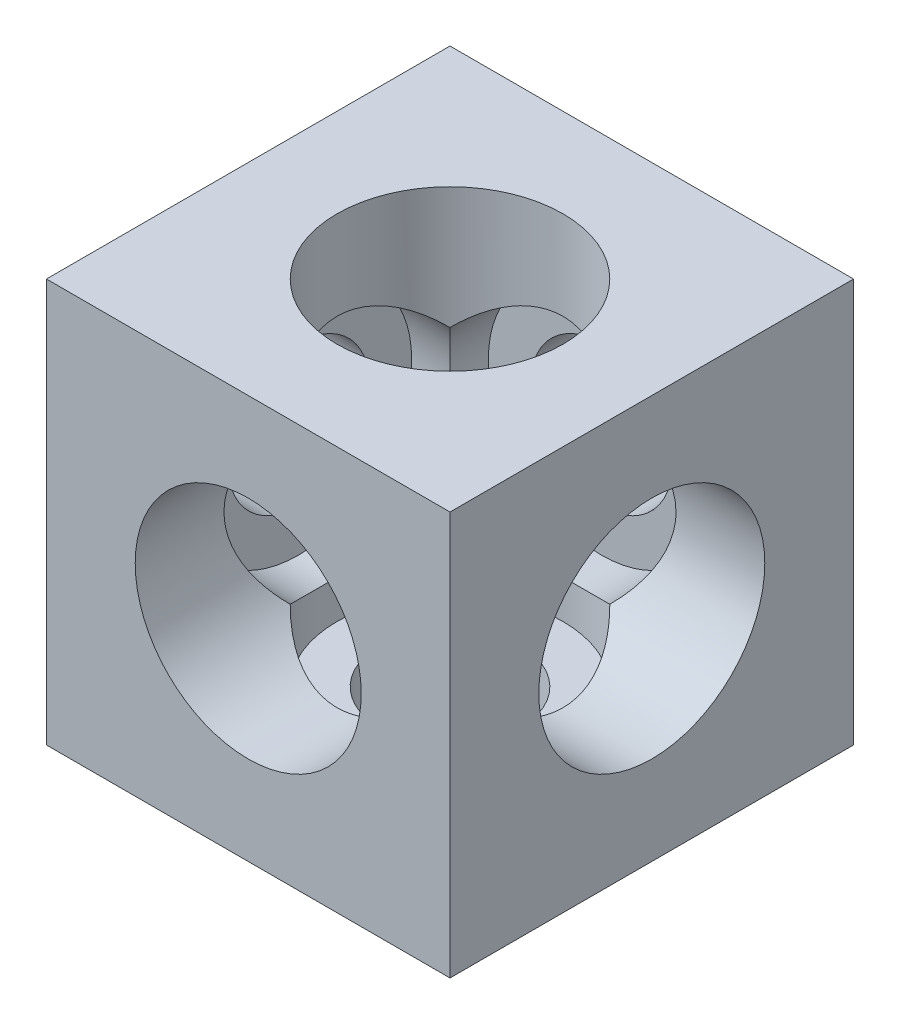
ISO-10303-21;
HEADER;
FILE_DESCRIPTION(('STEP AP214'),'2;1');
FILE_NAME('part.step','',(''),(''),'','','');
FILE_SCHEMA(('AUTOMOTIVE_DESIGN { 1 0 10303 214 1 1 1 1 }'));
ENDSEC;
DATA;
#1=APPLICATION_CONTEXT('core data for automotive mechanical design processes');
#2=APPLICATION_PROTOCOL_DEFINITION('international standard','automotive_design',2000,#1);
#3=PRODUCT_CONTEXT('',#1,'mechanical');
#4=PRODUCT('Part','Part','',(#3));
#5=PRODUCT_RELATED_PRODUCT_CATEGORY('part','',(#4));
#6=PRODUCT_DEFINITION_FORMATION('','',#4);
#7=PRODUCT_DEFINITION_CONTEXT('part definition',#1,'design');
#8=PRODUCT_DEFINITION('design','',#6,#7);
#9=PRODUCT_DEFINITION_SHAPE('','',#8);
#10=(LENGTH_UNIT() NAMED_UNIT(*) SI_UNIT(.MILLI.,.METRE.));
#11=(NAMED_UNIT(*) PLANE_ANGLE_UNIT() SI_UNIT($,.RADIAN.));
#12=(NAMED_UNIT(*) SI_UNIT($,.STERADIAN.) SOLID_ANGLE_UNIT());
#13=UNCERTAINTY_MEASURE_WITH_UNIT(LENGTH_MEASURE(1.E-05),#10,'distance_accuracy_value','');
#14=(GEOMETRIC_REPRESENTATION_CONTEXT(3) GLOBAL_UNCERTAINTY_ASSIGNED_CONTEXT((#13)) GLOBAL_UNIT_ASSIGNED_CONTEXT((#10,
#11,#12)) REPRESENTATION_CONTEXT('',''));
#15=CARTESIAN_POINT('',(0.,0.,0.));
#16=DIRECTION('',(0.,0.,1.));
#17=DIRECTION('',(1.,0.,0.));
#18=AXIS2_PLACEMENT_3D('',#15,#16,#17);
#19=CARTESIAN_POINT('',(-10.,0.,0.));
#20=DIRECTION('',(1.,0.,0.));
#21=DIRECTION('',(0.,0.,-1.));
#22=AXIS2_PLACEMENT_3D('',#19,#20,#21);
#23=CYLINDRICAL_SURFACE('',#22,3.5);
#24=CARTESIAN_POINT('',(-10.,0.,0.));
#25=DIRECTION('',(1.,0.,0.));
#26=DIRECTION('',(0.,0.,-1.));
#27=AXIS2_PLACEMENT_3D('',#24,#25,#26);
#28=CIRCLE('',#27,3.5);
#29=CARTESIAN_POINT('',(-10.,0.,-3.5));
#30=VERTEX_POINT('',#29);
#31=EDGE_CURVE('E145',#30,#30,#28,.T.);
#32=ORIENTED_EDGE('',*,*,#31,.F.);
#33=EDGE_LOOP('',(#32));
#34=FACE_BOUND('',#33,.T.);
#35=CARTESIAN_POINT('',(-7.5,0.,0.));
#36=DIRECTION('',(1.,0.,0.));
#37=DIRECTION('',(0.,0.,-1.));
#38=AXIS2_PLACEMENT_3D('',#35,#36,#37);
#39=CIRCLE('',#38,3.5);
#40=CARTESIAN_POINT('',(-7.5,0.,-3.5));
#41=VERTEX_POINT('',#40);
#42=EDGE_CURVE('E38',#41,#41,#39,.F.);
#43=ORIENTED_EDGE('',*,*,#42,.F.);
#44=EDGE_LOOP('',(#43));
#45=FACE_BOUND('',#44,.T.);
#46=ADVANCED_FACE('F34',(#34,#45),#23,.F.);
#47=CARTESIAN_POINT('',(0.,0.,-10.));
#48=DIRECTION('',(0.,0.,1.));
#49=DIRECTION('',(1.,0.,0.));
#50=AXIS2_PLACEMENT_3D('',#47,#48,#49);
#51=CYLINDRICAL_SURFACE('',#50,3.5);
#52=CARTESIAN_POINT('',(0.,0.,-10.));
#53=DIRECTION('',(0.,0.,1.));
#54=DIRECTION('',(1.,0.,0.));
#55=AXIS2_PLACEMENT_3D('',#52,#53,#54);
#56=CIRCLE('',#55,3.5);
#57=CARTESIAN_POINT('',(3.5,0.,-10.));
#58=VERTEX_POINT('',#57);
#59=EDGE_CURVE('E148',#58,#58,#56,.T.);
#60=ORIENTED_EDGE('',*,*,#59,.F.);
#61=EDGE_LOOP('',(#60));
#62=FACE_BOUND('',#61,.T.);
#63=CARTESIAN_POINT('',(0.,0.,-7.5));
#64=DIRECTION('',(0.,0.,1.));
#65=DIRECTION('',(1.,0.,0.));
#66=AXIS2_PLACEMENT_3D('',#63,#64,#65);
#67=CIRCLE('',#66,3.5);
#68=CARTESIAN_POINT('',(3.5,0.,-7.5));
#69=VERTEX_POINT('',#68);
#70=EDGE_CURVE('E122',#69,#69,#67,.F.);
#71=ORIENTED_EDGE('',*,*,#70,.F.);
#72=EDGE_LOOP('',(#71));
#73=FACE_BOUND('',#72,.T.);
#74=ADVANCED_FACE('F223',(#62,#73),#51,.F.);
#75=CARTESIAN_POINT('',(0.,-7.5,0.));
#76=DIRECTION('',(0.,1.,0.));
#77=DIRECTION('',(-1.,0.,0.));
#78=AXIS2_PLACEMENT_3D('',#75,#76,#77);
#79=CYLINDRICAL_SURFACE('',#78,5.6);
#80=CARTESIAN_POINT('',(0.,10.,0.));
#81=DIRECTION('',(0.,1.,0.));
#82=DIRECTION('',(-1.,0.,0.));
#83=AXIS2_PLACEMENT_3D('',#80,#81,#82);
#84=CIRCLE('',#83,5.6);
#85=CARTESIAN_POINT('',(-5.6,10.,0.));
#86=VERTEX_POINT('',#85);
#87=EDGE_CURVE('E124',#86,#86,#84,.T.);
#88=ORIENTED_EDGE('',*,*,#87,.T.);
#89=EDGE_LOOP('',(#88));
#90=FACE_BOUND('',#89,.T.);
#91=CARTESIAN_POINT('',(0.,0.,0.));
#92=DIRECTION('',(0.,0.707106781186547,-0.707106781186547));
#93=DIRECTION('',(0.,0.707106781186547,0.707106781186547));
#94=AXIS2_PLACEMENT_3D('',#91,#92,#93);
#95=ELLIPSE('',#94,7.91959594928933,5.6);
#96=CARTESIAN_POINT('',(3.95979797464466,3.95979797464467,3.95979797464467));
#97=VERTEX_POINT('',#96);
#98=CARTESIAN_POINT('',(-3.95979797464467,3.95979797464467,3.95979797464467));
#99=VERTEX_POINT('',#98);
#100=EDGE_CURVE('E111',#97,#99,#95,.F.);
#101=ORIENTED_EDGE('',*,*,#100,.T.);
#102=CARTESIAN_POINT('',(0.,0.,0.));
#103=DIRECTION('',(0.707106781186547,0.707106781186548,0.));
#104=DIRECTION('',(-0.707106781186547,0.707106781186547,0.));
#105=AXIS2_PLACEMENT_3D('',#102,#103,#104);
#106=ELLIPSE('',#105,7.91959594928933,5.6);
#107=CARTESIAN_POINT('',(-3.95979797464466,3.95979797464466,-3.95979797464467));
#108=VERTEX_POINT('',#107);
#109=EDGE_CURVE('E98',#99,#108,#106,.F.);
#110=ORIENTED_EDGE('',*,*,#109,.T.);
#111=CARTESIAN_POINT('',(0.,0.,0.));
#112=DIRECTION('',(0.,0.707106781186547,0.707106781186547));
#113=DIRECTION('',(0.,0.707106781186547,-0.707106781186547));
#114=AXIS2_PLACEMENT_3D('',#111,#112,#113);
#115=ELLIPSE('',#114,7.91959594928933,5.6);
#116=CARTESIAN_POINT('',(3.95979797464466,3.95979797464466,-3.95979797464467));
#117=VERTEX_POINT('',#116);
#118=EDGE_CURVE('E104',#108,#117,#115,.F.);
#119=ORIENTED_EDGE('',*,*,#118,.T.);
#120=CARTESIAN_POINT('',(0.,0.,0.));
#121=DIRECTION('',(-0.707106781186547,0.707106781186547,0.));
#122=DIRECTION('',(0.707106781186547,0.707106781186548,0.));
#123=AXIS2_PLACEMENT_3D('',#120,#121,#122);
#124=ELLIPSE('',#123,7.91959594928933,5.6);
#125=EDGE_CURVE('E50',#117,#97,#124,.F.);
#126=ORIENTED_EDGE('',*,*,#125,.T.);
#127=EDGE_LOOP('',(#101,#110,#119,#126));
#128=FACE_BOUND('',#127,.T.);
#129=ADVANCED_FACE('F109',(#90,#128),#79,.F.);
#130=CARTESIAN_POINT('',(0.,-10.,0.));
#131=DIRECTION('',(0.,1.,0.));
#132=DIRECTION('',(-1.,0.,0.));
#133=AXIS2_PLACEMENT_3D('',#130,#131,#132);
#134=CYLINDRICAL_SURFACE('',#133,3.5);
#135=CARTESIAN_POINT('',(0.,-10.,0.));
#136=DIRECTION('',(0.,1.,0.));
#137=DIRECTION('',(-1.,0.,0.));
#138=AXIS2_PLACEMENT_3D('',#135,#136,#137);
#139=CIRCLE('',#138,3.5);
#140=CARTESIAN_POINT('',(-3.5,-10.,0.));
#141=VERTEX_POINT('',#140);
#142=EDGE_CURVE('E151',#141,#141,#139,.T.);
#143=ORIENTED_EDGE('',*,*,#142,.F.);
#144=EDGE_LOOP('',(#143));
#145=FACE_BOUND('',#144,.T.);
#146=CARTESIAN_POINT('',(0.,-7.5,0.));
#147=DIRECTION('',(0.,1.,0.));
#148=DIRECTION('',(-1.,0.,0.));
#149=AXIS2_PLACEMENT_3D('',#146,#147,#148);
#150=CIRCLE('',#149,3.5);
#151=CARTESIAN_POINT('',(-3.5,-7.5,0.));
#152=VERTEX_POINT('',#151);
#153=EDGE_CURVE('E143',#152,#152,#150,.F.);
#154=ORIENTED_EDGE('',*,*,#153,.F.);
#155=EDGE_LOOP('',(#154));
#156=FACE_BOUND('',#155,.T.);
#157=ADVANCED_FACE('F236',(#145,#156),#134,.F.);
#158=CARTESIAN_POINT('',(-10.,-10.,10.));
#159=DIRECTION('',(1.,0.,0.));
#160=DIRECTION('',(0.,0.,-1.));
#161=AXIS2_PLACEMENT_3D('',#158,#159,#160);
#162=PLANE('',#161);
#163=ORIENTED_EDGE('',*,*,#31,.T.);
#164=EDGE_LOOP('',(#163));
#165=FACE_BOUND('',#164,.T.);
#166=DIRECTION('',(0.,-1.,0.));
#167=VECTOR('',#166,1.);
#168=CARTESIAN_POINT('',(-10.,-10.,-10.));
#169=LINE('',#168,#167);
#170=CARTESIAN_POINT('',(-10.,10.,-10.));
#171=VERTEX_POINT('',#170);
#172=CARTESIAN_POINT('',(-10.,-10.,-10.));
#173=VERTEX_POINT('',#172);
#174=EDGE_CURVE('E154',#171,#173,#169,.T.);
#175=ORIENTED_EDGE('',*,*,#174,.T.);
#176=DIRECTION('',(0.,0.,-1.));
#177=VECTOR('',#176,1.);
#178=CARTESIAN_POINT('',(-10.,-10.,10.));
#179=LINE('',#178,#177);
#180=CARTESIAN_POINT('',(-10.,-10.,10.));
#181=VERTEX_POINT('',#180);
#182=EDGE_CURVE('E181',#181,#173,#179,.T.);
#183=ORIENTED_EDGE('',*,*,#182,.F.);
#184=DIRECTION('',(0.,-1.,0.));
#185=VECTOR('',#184,1.);
#186=CARTESIAN_POINT('',(-10.,-10.,10.));
#187=LINE('',#186,#185);
#188=CARTESIAN_POINT('',(-10.,10.,10.));
#189=VERTEX_POINT('',#188);
#190=EDGE_CURVE('E155',#189,#181,#187,.T.);
#191=ORIENTED_EDGE('',*,*,#190,.F.);
#192=DIRECTION('',(0.,0.,-1.));
#193=VECTOR('',#192,1.);
#194=CARTESIAN_POINT('',(-10.,10.,10.));
#195=LINE('',#194,#193);
#196=EDGE_CURVE('E165',#189,#171,#195,.T.);
#197=ORIENTED_EDGE('',*,*,#196,.T.);
#198=EDGE_LOOP('',(#175,#183,#191,#197));
#199=FACE_BOUND('',#198,.T.);
#200=ADVANCED_FACE('F36',(#165,#199),#162,.F.);
#201=CARTESIAN_POINT('',(10.,-9.99999999999999,10.));
#202=DIRECTION('',(0.,1.,0.));
#203=DIRECTION('',(-1.,0.,0.));
#204=AXIS2_PLACEMENT_3D('',#201,#202,#203);
#205=PLANE('',#204);
#206=ORIENTED_EDGE('',*,*,#142,.T.);
#207=EDGE_LOOP('',(#206));
#208=FACE_BOUND('',#207,.T.);
#209=DIRECTION('',(1.,0.,0.));
#210=VECTOR('',#209,1.);
#211=CARTESIAN_POINT('',(10.,-9.99999999999999,-10.));
#212=LINE('',#211,#210);
#213=CARTESIAN_POINT('',(10.,-9.99999999999999,-10.));
#214=VERTEX_POINT('',#213);
#215=EDGE_CURVE('E168',#173,#214,#212,.T.);
#216=ORIENTED_EDGE('',*,*,#215,.T.);
#217=DIRECTION('',(0.,0.,-1.));
#218=VECTOR('',#217,1.);
#219=CARTESIAN_POINT('',(10.,-9.99999999999999,10.));
#220=LINE('',#219,#218);
#221=CARTESIAN_POINT('',(10.,-9.99999999999999,10.));
#222=VERTEX_POINT('',#221);
#223=EDGE_CURVE('E178',#222,#214,#220,.T.);
#224=ORIENTED_EDGE('',*,*,#223,.F.);
#225=DIRECTION('',(1.,0.,0.));
#226=VECTOR('',#225,1.);
#227=CARTESIAN_POINT('',(10.,-9.99999999999999,10.));
#228=LINE('',#227,#226);
#229=EDGE_CURVE('E158',#181,#222,#228,.T.);
#230=ORIENTED_EDGE('',*,*,#229,.F.);
#231=ORIENTED_EDGE('',*,*,#182,.T.);
#232=EDGE_LOOP('',(#216,#224,#230,#231));
#233=FACE_BOUND('',#232,.T.);
#234=ADVANCED_FACE('F255',(#208,#233),#205,.F.);
#235=CARTESIAN_POINT('',(10.,-9.99999999999999,10.));
#236=DIRECTION('',(-1.,0.,0.));
#237=DIRECTION('',(0.,0.,1.));
#238=AXIS2_PLACEMENT_3D('',#235,#236,#237);
#239=PLANE('',#238);
#240=CARTESIAN_POINT('',(10.,0.,0.));
#241=DIRECTION('',(1.,0.,0.));
#242=DIRECTION('',(0.,0.,-1.));
#243=AXIS2_PLACEMENT_3D('',#240,#241,#242);
#244=CIRCLE('',#243,5.6);
#245=CARTESIAN_POINT('',(10.,0.,-5.6));
#246=VERTEX_POINT('',#245);
#247=EDGE_CURVE('E198',#246,#246,#244,.T.);
#248=ORIENTED_EDGE('',*,*,#247,.F.);
#249=EDGE_LOOP('',(#248));
#250=FACE_BOUND('',#249,.T.);
#251=DIRECTION('',(0.,1.,0.));
#252=VECTOR('',#251,1.);
#253=CARTESIAN_POINT('',(10.,-9.99999999999999,-10.));
#254=LINE('',#253,#252);
#255=CARTESIAN_POINT('',(10.,10.,-10.));
#256=VERTEX_POINT('',#255);
#257=EDGE_CURVE('E170',#214,#256,#254,.T.);
#258=ORIENTED_EDGE('',*,*,#257,.T.);
#259=DIRECTION('',(0.,0.,-1.));
#260=VECTOR('',#259,1.);
#261=CARTESIAN_POINT('',(10.,10.,10.));
#262=LINE('',#261,#260);
#263=CARTESIAN_POINT('',(10.,10.,10.));
#264=VERTEX_POINT('',#263);
#265=EDGE_CURVE('E175',#264,#256,#262,.T.);
#266=ORIENTED_EDGE('',*,*,#265,.F.);
#267=DIRECTION('',(0.,1.,0.));
#268=VECTOR('',#267,1.);
#269=CARTESIAN_POINT('',(10.,-9.99999999999999,10.));
#270=LINE('',#269,#268);
#271=EDGE_CURVE('E161',#222,#264,#270,.T.);
#272=ORIENTED_EDGE('',*,*,#271,.F.);
#273=ORIENTED_EDGE('',*,*,#223,.T.);
#274=EDGE_LOOP('',(#258,#266,#272,#273));
#275=FACE_BOUND('',#274,.T.);
#276=ADVANCED_FACE('F252',(#250,#275),#239,.F.);
#277=CARTESIAN_POINT('',(10.,10.,10.));
#278=DIRECTION('',(0.,-1.,0.));
#279=DIRECTION('',(1.,0.,0.));
#280=AXIS2_PLACEMENT_3D('',#277,#278,#279);
#281=PLANE('',#280);
#282=ORIENTED_EDGE('',*,*,#87,.F.);
#283=EDGE_LOOP('',(#282));
#284=FACE_BOUND('',#283,.T.);
#285=DIRECTION('',(-1.,0.,0.));
#286=VECTOR('',#285,1.);
#287=CARTESIAN_POINT('',(10.,10.,-10.));
#288=LINE('',#287,#286);
#289=EDGE_CURVE('E159',#256,#171,#288,.T.);
#290=ORIENTED_EDGE('',*,*,#289,.T.);
#291=ORIENTED_EDGE('',*,*,#196,.F.);
#292=DIRECTION('',(-1.,0.,0.));
#293=VECTOR('',#292,1.);
#294=CARTESIAN_POINT('',(10.,10.,10.));
#295=LINE('',#294,#293);
#296=EDGE_CURVE('E163',#264,#189,#295,.T.);
#297=ORIENTED_EDGE('',*,*,#296,.F.);
#298=ORIENTED_EDGE('',*,*,#265,.T.);
#299=EDGE_LOOP('',(#290,#291,#297,#298));
#300=FACE_BOUND('',#299,.T.);
#301=ADVANCED_FACE('F244',(#284,#300),#281,.F.);
#302=CARTESIAN_POINT('',(0.,0.,10.));
#303=DIRECTION('',(0.,0.,1.));
#304=DIRECTION('',(1.,0.,0.));
#305=AXIS2_PLACEMENT_3D('',#302,#303,#304);
#306=PLANE('',#305);
#307=CARTESIAN_POINT('',(0.,0.,10.));
#308=DIRECTION('',(0.,0.,1.));
#309=DIRECTION('',(1.,0.,0.));
#310=AXIS2_PLACEMENT_3D('',#307,#308,#309);
#311=CIRCLE('',#310,5.6);
#312=CARTESIAN_POINT('',(5.6,0.,10.));
#313=VERTEX_POINT('',#312);
#314=EDGE_CURVE('E132',#313,#313,#311,.T.);
#315=ORIENTED_EDGE('',*,*,#314,.F.);
#316=EDGE_LOOP('',(#315));
#317=FACE_BOUND('',#316,.T.);
#318=ORIENTED_EDGE('',*,*,#190,.T.);
#319=ORIENTED_EDGE('',*,*,#229,.T.);
#320=ORIENTED_EDGE('',*,*,#271,.T.);
#321=ORIENTED_EDGE('',*,*,#296,.T.);
#322=EDGE_LOOP('',(#318,#319,#320,#321));
#323=FACE_BOUND('',#322,.T.);
#324=ADVANCED_FACE('F240',(#317,#323),#306,.T.);
#325=CARTESIAN_POINT('',(0.,0.,-10.));
#326=DIRECTION('',(0.,0.,1.));
#327=DIRECTION('',(1.,0.,0.));
#328=AXIS2_PLACEMENT_3D('',#325,#326,#327);
#329=PLANE('',#328);
#330=ORIENTED_EDGE('',*,*,#59,.T.);
#331=EDGE_LOOP('',(#330));
#332=FACE_BOUND('',#331,.T.);
#333=ORIENTED_EDGE('',*,*,#174,.F.);
#334=ORIENTED_EDGE('',*,*,#289,.F.);
#335=ORIENTED_EDGE('',*,*,#257,.F.);
#336=ORIENTED_EDGE('',*,*,#215,.F.);
#337=EDGE_LOOP('',(#333,#334,#335,#336));
#338=FACE_BOUND('',#337,.T.);
#339=ADVANCED_FACE('F243',(#332,#338),#329,.F.);
#340=CARTESIAN_POINT('',(0.,-7.5,0.));
#341=DIRECTION('',(0.,1.,0.));
#342=DIRECTION('',(-1.,0.,0.));
#343=AXIS2_PLACEMENT_3D('',#340,#341,#342);
#344=PLANE('',#343);
#345=CARTESIAN_POINT('',(0.,-7.5,0.));
#346=DIRECTION('',(0.,1.,0.));
#347=DIRECTION('',(-1.,0.,0.));
#348=AXIS2_PLACEMENT_3D('',#345,#346,#347);
#349=CIRCLE('',#348,5.6);
#350=CARTESIAN_POINT('',(-5.6,-7.5,0.));
#351=VERTEX_POINT('',#350);
#352=EDGE_CURVE('E129',#351,#351,#349,.T.);
#353=ORIENTED_EDGE('',*,*,#352,.T.);
#354=EDGE_LOOP('',(#353));
#355=FACE_BOUND('',#354,.T.);
#356=ORIENTED_EDGE('',*,*,#153,.T.);
#357=EDGE_LOOP('',(#356));
#358=FACE_BOUND('',#357,.T.);
#359=ADVANCED_FACE('F248',(#355,#358),#344,.T.);
#360=CARTESIAN_POINT('',(0.,0.,0.));
#361=DIRECTION('',(0.,0.707106781186547,0.707106781186547));
#362=DIRECTION('',(0.,0.707106781186547,-0.707106781186547));
#363=AXIS2_PLACEMENT_3D('',#360,#361,#362);
#364=ELLIPSE('',#363,7.91959594928933,5.6);
#365=CARTESIAN_POINT('',(-3.95979797464466,-3.95979797464467,3.95979797464467));
#366=VERTEX_POINT('',#365);
#367=CARTESIAN_POINT('',(3.95979797464467,-3.95979797464467,3.95979797464467));
#368=VERTEX_POINT('',#367);
#369=EDGE_CURVE('E115',#366,#368,#364,.T.);
#370=ORIENTED_EDGE('',*,*,#369,.T.);
#371=CARTESIAN_POINT('',(0.,0.,0.));
#372=DIRECTION('',(0.707106781186547,0.707106781186548,0.));
#373=DIRECTION('',(-0.707106781186547,0.707106781186547,0.));
#374=AXIS2_PLACEMENT_3D('',#371,#372,#373);
#375=ELLIPSE('',#374,7.91959594928933,5.6);
#376=CARTESIAN_POINT('',(3.95979797464466,-3.95979797464466,-3.95979797464467));
#377=VERTEX_POINT('',#376);
#378=EDGE_CURVE('E191',#368,#377,#375,.T.);
#379=ORIENTED_EDGE('',*,*,#378,.T.);
#380=CARTESIAN_POINT('',(0.,0.,0.));
#381=DIRECTION('',(0.,0.707106781186547,-0.707106781186547));
#382=DIRECTION('',(0.,0.707106781186547,0.707106781186547));
#383=AXIS2_PLACEMENT_3D('',#380,#381,#382);
#384=ELLIPSE('',#383,7.91959594928933,5.6);
#385=CARTESIAN_POINT('',(-3.95979797464466,-3.95979797464466,-3.95979797464467));
#386=VERTEX_POINT('',#385);
#387=EDGE_CURVE('E118',#377,#386,#384,.T.);
#388=ORIENTED_EDGE('',*,*,#387,.T.);
#389=CARTESIAN_POINT('',(0.,0.,0.));
#390=DIRECTION('',(-0.707106781186547,0.707106781186547,0.));
#391=DIRECTION('',(0.707106781186547,0.707106781186548,0.));
#392=AXIS2_PLACEMENT_3D('',#389,#390,#391);
#393=ELLIPSE('',#392,7.91959594928933,5.6);
#394=EDGE_CURVE('E57',#386,#366,#393,.T.);
#395=ORIENTED_EDGE('',*,*,#394,.T.);
#396=EDGE_LOOP('',(#370,#379,#388,#395));
#397=FACE_BOUND('',#396,.T.);
#398=ORIENTED_EDGE('',*,*,#352,.F.);
#399=EDGE_LOOP('',(#398));
#400=FACE_BOUND('',#399,.T.);
#401=ADVANCED_FACE('F188',(#397,#400),#79,.F.);
#402=CARTESIAN_POINT('',(0.,0.,-7.5));
#403=DIRECTION('',(0.,0.,1.));
#404=DIRECTION('',(1.,0.,0.));
#405=AXIS2_PLACEMENT_3D('',#402,#403,#404);
#406=CYLINDRICAL_SURFACE('',#405,5.6);
#407=ORIENTED_EDGE('',*,*,#314,.T.);
#408=EDGE_LOOP('',(#407));
#409=FACE_BOUND('',#408,.T.);
#410=ORIENTED_EDGE('',*,*,#369,.F.);
#411=CARTESIAN_POINT('',(0.,0.,0.));
#412=DIRECTION('',(0.707106781186547,0.,0.707106781186547));
#413=DIRECTION('',(-0.707106781186547,0.,0.707106781186547));
#414=AXIS2_PLACEMENT_3D('',#411,#412,#413);
#415=ELLIPSE('',#414,7.91959594928933,5.6);
#416=EDGE_CURVE('E112',#366,#99,#415,.F.);
#417=ORIENTED_EDGE('',*,*,#416,.T.);
#418=ORIENTED_EDGE('',*,*,#100,.F.);
#419=CARTESIAN_POINT('',(0.,0.,0.));
#420=DIRECTION('',(-0.707106781186547,0.,0.707106781186547));
#421=DIRECTION('',(0.707106781186547,0.,0.707106781186547));
#422=AXIS2_PLACEMENT_3D('',#419,#420,#421);
#423=ELLIPSE('',#422,7.91959594928933,5.6);
#424=EDGE_CURVE('E139',#97,#368,#423,.F.);
#425=ORIENTED_EDGE('',*,*,#424,.T.);
#426=EDGE_LOOP('',(#410,#417,#418,#425));
#427=FACE_BOUND('',#426,.T.);
#428=ADVANCED_FACE('F218',(#409,#427),#406,.F.);
#429=CARTESIAN_POINT('',(0.,0.,-7.5));
#430=DIRECTION('',(0.,0.,1.));
#431=DIRECTION('',(1.,0.,0.));
#432=AXIS2_PLACEMENT_3D('',#429,#430,#431);
#433=PLANE('',#432);
#434=CARTESIAN_POINT('',(0.,0.,-7.5));
#435=DIRECTION('',(0.,0.,1.));
#436=DIRECTION('',(1.,0.,0.));
#437=AXIS2_PLACEMENT_3D('',#434,#435,#436);
#438=CIRCLE('',#437,5.6);
#439=CARTESIAN_POINT('',(5.6,0.,-7.5));
#440=VERTEX_POINT('',#439);
#441=EDGE_CURVE('E125',#440,#440,#438,.T.);
#442=ORIENTED_EDGE('',*,*,#441,.T.);
#443=EDGE_LOOP('',(#442));
#444=FACE_BOUND('',#443,.T.);
#445=ORIENTED_EDGE('',*,*,#70,.T.);
#446=EDGE_LOOP('',(#445));
#447=FACE_BOUND('',#446,.T.);
#448=ADVANCED_FACE('F215',(#444,#447),#433,.T.);
#449=ORIENTED_EDGE('',*,*,#441,.F.);
#450=EDGE_LOOP('',(#449));
#451=FACE_BOUND('',#450,.T.);
#452=ORIENTED_EDGE('',*,*,#387,.F.);
#453=CARTESIAN_POINT('',(0.,0.,0.));
#454=DIRECTION('',(0.707106781186547,0.,0.707106781186547));
#455=DIRECTION('',(-0.707106781186547,0.,0.707106781186547));
#456=AXIS2_PLACEMENT_3D('',#453,#454,#455);
#457=ELLIPSE('',#456,7.91959594928933,5.6);
#458=EDGE_CURVE('E11',#377,#117,#457,.T.);
#459=ORIENTED_EDGE('',*,*,#458,.T.);
#460=ORIENTED_EDGE('',*,*,#118,.F.);
#461=CARTESIAN_POINT('',(0.,0.,0.));
#462=DIRECTION('',(-0.707106781186547,0.,0.707106781186547));
#463=DIRECTION('',(0.707106781186547,0.,0.707106781186547));
#464=AXIS2_PLACEMENT_3D('',#461,#462,#463);
#465=ELLIPSE('',#464,7.91959594928933,5.6);
#466=EDGE_CURVE('E43',#108,#386,#465,.T.);
#467=ORIENTED_EDGE('',*,*,#466,.T.);
#468=EDGE_LOOP('',(#452,#459,#460,#467));
#469=FACE_BOUND('',#468,.T.);
#470=ADVANCED_FACE('F114',(#451,#469),#406,.F.);
#471=CARTESIAN_POINT('',(-7.5,0.,0.));
#472=DIRECTION('',(1.,0.,0.));
#473=DIRECTION('',(0.,0.,-1.));
#474=AXIS2_PLACEMENT_3D('',#471,#472,#473);
#475=CYLINDRICAL_SURFACE('',#474,5.6);
#476=CARTESIAN_POINT('',(-7.5,0.,0.));
#477=DIRECTION('',(1.,0.,0.));
#478=DIRECTION('',(0.,0.,-1.));
#479=AXIS2_PLACEMENT_3D('',#476,#477,#478);
#480=CIRCLE('',#479,5.6);
#481=CARTESIAN_POINT('',(-7.5,0.,-5.6));
#482=VERTEX_POINT('',#481);
#483=EDGE_CURVE('E197',#482,#482,#480,.T.);
#484=ORIENTED_EDGE('',*,*,#483,.F.);
#485=EDGE_LOOP('',(#484));
#486=FACE_BOUND('',#485,.T.);
#487=ORIENTED_EDGE('',*,*,#394,.F.);
#488=ORIENTED_EDGE('',*,*,#466,.F.);
#489=ORIENTED_EDGE('',*,*,#109,.F.);
#490=ORIENTED_EDGE('',*,*,#416,.F.);
#491=EDGE_LOOP('',(#487,#488,#489,#490));
#492=FACE_BOUND('',#491,.T.);
#493=ADVANCED_FACE('F97',(#486,#492),#475,.F.);
#494=CARTESIAN_POINT('',(-7.5,0.,0.));
#495=DIRECTION('',(1.,0.,0.));
#496=DIRECTION('',(0.,0.,-1.));
#497=AXIS2_PLACEMENT_3D('',#494,#495,#496);
#498=PLANE('',#497);
#499=ORIENTED_EDGE('',*,*,#483,.T.);
#500=EDGE_LOOP('',(#499));
#501=FACE_BOUND('',#500,.T.);
#502=ORIENTED_EDGE('',*,*,#42,.T.);
#503=EDGE_LOOP('',(#502));
#504=FACE_BOUND('',#503,.T.);
#505=ADVANCED_FACE('F204',(#501,#504),#498,.T.);
#506=ORIENTED_EDGE('',*,*,#247,.T.);
#507=EDGE_LOOP('',(#506));
#508=FACE_BOUND('',#507,.T.);
#509=ORIENTED_EDGE('',*,*,#125,.F.);
#510=ORIENTED_EDGE('',*,*,#458,.F.);
#511=ORIENTED_EDGE('',*,*,#378,.F.);
#512=ORIENTED_EDGE('',*,*,#424,.F.);
#513=EDGE_LOOP('',(#509,#510,#511,#512));
#514=FACE_BOUND('',#513,.T.);
#515=ADVANCED_FACE('F209',(#508,#514),#475,.F.);
#516=CLOSED_SHELL('',(#46,#74,#129,#157,#200,#234,#276,#301,#324,#339,#359,#401,#428,#448,#470,
#493,#505,#515));
#517=MANIFOLD_SOLID_BREP('B2',#516);
#518=ADVANCED_BREP_SHAPE_REPRESENTATION('',(#18,#517),#14);
#519=SHAPE_DEFINITION_REPRESENTATION(#9,#518);
ENDSEC;
END-ISO-10303-21;
